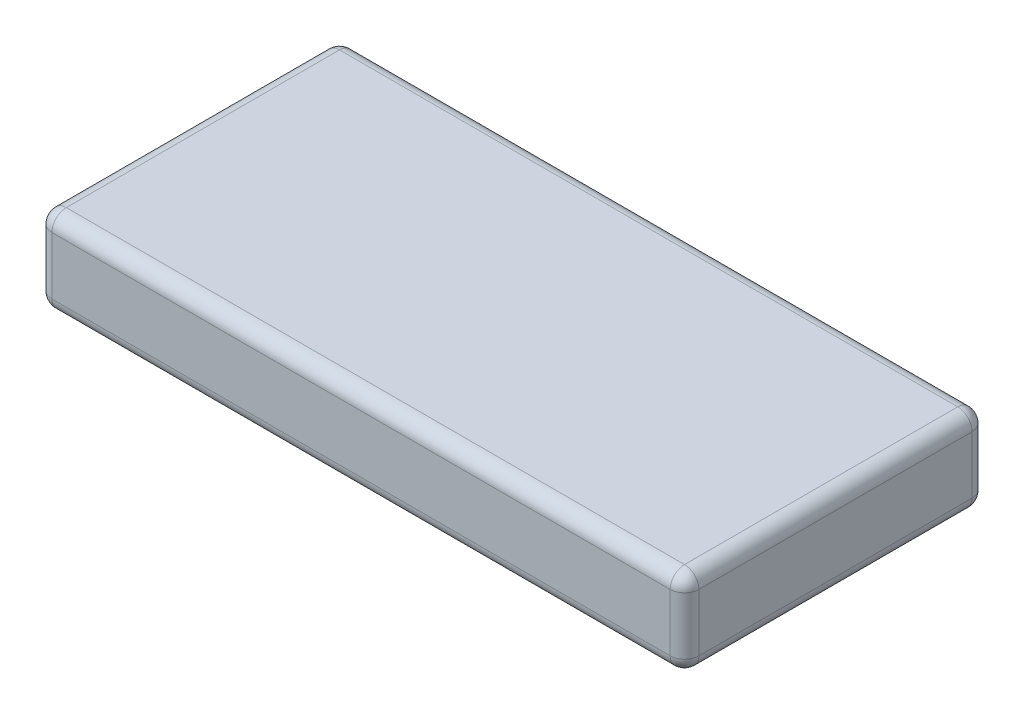
ISO-10303-21;
HEADER;
FILE_DESCRIPTION(('STEP AP214'),'2;1');
FILE_NAME('part.step','',(''),(''),'','','');
FILE_SCHEMA(('AUTOMOTIVE_DESIGN { 1 0 10303 214 1 1 1 1 }'));
ENDSEC;
DATA;
#1=APPLICATION_CONTEXT('core data for automotive mechanical design processes');
#2=APPLICATION_PROTOCOL_DEFINITION('international standard','automotive_design',2000,#1);
#3=PRODUCT_CONTEXT('',#1,'mechanical');
#4=PRODUCT('Part','Part','',(#3));
#5=PRODUCT_RELATED_PRODUCT_CATEGORY('part','',(#4));
#6=PRODUCT_DEFINITION_FORMATION('','',#4);
#7=PRODUCT_DEFINITION_CONTEXT('part definition',#1,'design');
#8=PRODUCT_DEFINITION('design','',#6,#7);
#9=PRODUCT_DEFINITION_SHAPE('','',#8);
#10=(LENGTH_UNIT() NAMED_UNIT(*) SI_UNIT(.MILLI.,.METRE.));
#11=(NAMED_UNIT(*) PLANE_ANGLE_UNIT() SI_UNIT($,.RADIAN.));
#12=(NAMED_UNIT(*) SI_UNIT($,.STERADIAN.) SOLID_ANGLE_UNIT());
#13=UNCERTAINTY_MEASURE_WITH_UNIT(LENGTH_MEASURE(1.E-05),#10,'distance_accuracy_value','');
#14=(GEOMETRIC_REPRESENTATION_CONTEXT(3) GLOBAL_UNCERTAINTY_ASSIGNED_CONTEXT((#13)) GLOBAL_UNIT_ASSIGNED_CONTEXT((#10,
#11,#12)) REPRESENTATION_CONTEXT('',''));
#15=CARTESIAN_POINT('',(0.,0.,0.));
#16=DIRECTION('',(0.,0.,1.));
#17=DIRECTION('',(1.,0.,0.));
#18=AXIS2_PLACEMENT_3D('',#15,#16,#17);
#19=CARTESIAN_POINT('',(0.,22.86,0.));
#20=DIRECTION('',(1.,0.,0.));
#21=DIRECTION('',(0.,0.,-1.));
#22=AXIS2_PLACEMENT_3D('',#19,#20,#21);
#23=PLANE('',#22);
#24=DIRECTION('',(0.,0.,1.));
#25=VECTOR('',#24,1.);
#26=CARTESIAN_POINT('',(0.,19.05,0.));
#27=LINE('',#26,#25);
#28=CARTESIAN_POINT('',(0.,19.05,-3.81));
#29=VERTEX_POINT('',#28);
#30=CARTESIAN_POINT('',(0.,19.05,-76.2));
#31=VERTEX_POINT('',#30);
#32=EDGE_CURVE('E186',#29,#31,#27,.F.);
#33=ORIENTED_EDGE('',*,*,#32,.T.);
#34=DIRECTION('',(0.,-1.,0.));
#35=VECTOR('',#34,1.);
#36=CARTESIAN_POINT('',(0.,22.86,-76.2));
#37=LINE('',#36,#35);
#38=CARTESIAN_POINT('',(0.,3.81,-76.2));
#39=VERTEX_POINT('',#38);
#40=EDGE_CURVE('E140',#31,#39,#37,.T.);
#41=ORIENTED_EDGE('',*,*,#40,.T.);
#42=DIRECTION('',(0.,0.,1.));
#43=VECTOR('',#42,1.);
#44=CARTESIAN_POINT('',(0.,3.81,0.));
#45=LINE('',#44,#43);
#46=CARTESIAN_POINT('',(0.,3.81,-3.81));
#47=VERTEX_POINT('',#46);
#48=EDGE_CURVE('E188',#39,#47,#45,.T.);
#49=ORIENTED_EDGE('',*,*,#48,.T.);
#50=DIRECTION('',(0.,-1.,0.));
#51=VECTOR('',#50,1.);
#52=CARTESIAN_POINT('',(0.,22.86,-3.81));
#53=LINE('',#52,#51);
#54=EDGE_CURVE('E184',#47,#29,#53,.F.);
#55=ORIENTED_EDGE('',*,*,#54,.T.);
#56=EDGE_LOOP('',(#33,#41,#49,#55));
#57=FACE_BOUND('',#56,.T.);
#58=ADVANCED_FACE('F34',(#57),#23,.F.);
#59=CARTESIAN_POINT('',(0.,22.86,0.));
#60=DIRECTION('',(0.,0.,-1.));
#61=DIRECTION('',(-1.,0.,0.));
#62=AXIS2_PLACEMENT_3D('',#59,#60,#61);
#63=PLANE('',#62);
#64=DIRECTION('',(1.,0.,0.));
#65=VECTOR('',#64,1.);
#66=CARTESIAN_POINT('',(0.,19.05,0.));
#67=LINE('',#66,#65);
#68=CARTESIAN_POINT('',(167.64,19.05,0.));
#69=VERTEX_POINT('',#68);
#70=CARTESIAN_POINT('',(3.81,19.05,0.));
#71=VERTEX_POINT('',#70);
#72=EDGE_CURVE('E43',#69,#71,#67,.F.);
#73=ORIENTED_EDGE('',*,*,#72,.T.);
#74=DIRECTION('',(0.,-1.,0.));
#75=VECTOR('',#74,1.);
#76=CARTESIAN_POINT('',(3.81,22.86,0.));
#77=LINE('',#76,#75);
#78=CARTESIAN_POINT('',(3.81,3.81,0.));
#79=VERTEX_POINT('',#78);
#80=EDGE_CURVE('E11',#71,#79,#77,.T.);
#81=ORIENTED_EDGE('',*,*,#80,.T.);
#82=DIRECTION('',(1.,0.,0.));
#83=VECTOR('',#82,1.);
#84=CARTESIAN_POINT('',(171.45,3.81,0.));
#85=LINE('',#84,#83);
#86=CARTESIAN_POINT('',(167.64,3.81,0.));
#87=VERTEX_POINT('',#86);
#88=EDGE_CURVE('E200',#79,#87,#85,.T.);
#89=ORIENTED_EDGE('',*,*,#88,.T.);
#90=DIRECTION('',(0.,-1.,0.));
#91=VECTOR('',#90,1.);
#92=CARTESIAN_POINT('',(167.64,22.86,0.));
#93=LINE('',#92,#91);
#94=EDGE_CURVE('E54',#87,#69,#93,.F.);
#95=ORIENTED_EDGE('',*,*,#94,.T.);
#96=EDGE_LOOP('',(#73,#81,#89,#95));
#97=FACE_BOUND('',#96,.T.);
#98=ADVANCED_FACE('F273',(#97),#63,.F.);
#99=CARTESIAN_POINT('',(171.45,22.86,0.));
#100=DIRECTION('',(-1.,0.,0.));
#101=DIRECTION('',(0.,0.,1.));
#102=AXIS2_PLACEMENT_3D('',#99,#100,#101);
#103=PLANE('',#102);
#104=DIRECTION('',(0.,0.,-1.));
#105=VECTOR('',#104,1.);
#106=CARTESIAN_POINT('',(171.45,3.81,-80.01));
#107=LINE('',#106,#105);
#108=CARTESIAN_POINT('',(171.45,3.81,-3.81));
#109=VERTEX_POINT('',#108);
#110=CARTESIAN_POINT('',(171.45,3.81,-76.2));
#111=VERTEX_POINT('',#110);
#112=EDGE_CURVE('E170',#109,#111,#107,.T.);
#113=ORIENTED_EDGE('',*,*,#112,.T.);
#114=DIRECTION('',(0.,-1.,0.));
#115=VECTOR('',#114,1.);
#116=CARTESIAN_POINT('',(171.45,22.86,-76.2));
#117=LINE('',#116,#115);
#118=CARTESIAN_POINT('',(171.45,19.05,-76.2));
#119=VERTEX_POINT('',#118);
#120=EDGE_CURVE('E172',#111,#119,#117,.F.);
#121=ORIENTED_EDGE('',*,*,#120,.T.);
#122=DIRECTION('',(0.,0.,-1.));
#123=VECTOR('',#122,1.);
#124=CARTESIAN_POINT('',(171.45,19.05,0.));
#125=LINE('',#124,#123);
#126=CARTESIAN_POINT('',(171.45,19.05,-3.81));
#127=VERTEX_POINT('',#126);
#128=EDGE_CURVE('E168',#119,#127,#125,.F.);
#129=ORIENTED_EDGE('',*,*,#128,.T.);
#130=DIRECTION('',(0.,-1.,0.));
#131=VECTOR('',#130,1.);
#132=CARTESIAN_POINT('',(171.45,22.86,-3.81));
#133=LINE('',#132,#131);
#134=EDGE_CURVE('E166',#127,#109,#133,.T.);
#135=ORIENTED_EDGE('',*,*,#134,.T.);
#136=EDGE_LOOP('',(#113,#121,#129,#135));
#137=FACE_BOUND('',#136,.T.);
#138=ADVANCED_FACE('F333',(#137),#103,.F.);
#139=CARTESIAN_POINT('',(0.,22.86,-80.01));
#140=DIRECTION('',(0.,0.,1.));
#141=DIRECTION('',(1.,0.,0.));
#142=AXIS2_PLACEMENT_3D('',#139,#140,#141);
#143=PLANE('',#142);
#144=DIRECTION('',(-1.,0.,0.));
#145=VECTOR('',#144,1.);
#146=CARTESIAN_POINT('',(0.,19.05,-80.01));
#147=LINE('',#146,#145);
#148=CARTESIAN_POINT('',(3.81,19.05,-80.01));
#149=VERTEX_POINT('',#148);
#150=CARTESIAN_POINT('',(167.64,19.05,-80.01));
#151=VERTEX_POINT('',#150);
#152=EDGE_CURVE('E126',#149,#151,#147,.F.);
#153=ORIENTED_EDGE('',*,*,#152,.T.);
#154=DIRECTION('',(0.,-1.,0.));
#155=VECTOR('',#154,1.);
#156=CARTESIAN_POINT('',(167.64,22.86,-80.01));
#157=LINE('',#156,#155);
#158=CARTESIAN_POINT('',(167.64,3.81,-80.01));
#159=VERTEX_POINT('',#158);
#160=EDGE_CURVE('E164',#151,#159,#157,.T.);
#161=ORIENTED_EDGE('',*,*,#160,.T.);
#162=DIRECTION('',(-1.,0.,0.));
#163=VECTOR('',#162,1.);
#164=CARTESIAN_POINT('',(0.,3.81,-80.01));
#165=LINE('',#164,#163);
#166=CARTESIAN_POINT('',(3.81,3.81,-80.01));
#167=VERTEX_POINT('',#166);
#168=EDGE_CURVE('E129',#159,#167,#165,.T.);
#169=ORIENTED_EDGE('',*,*,#168,.T.);
#170=DIRECTION('',(0.,-1.,0.));
#171=VECTOR('',#170,1.);
#172=CARTESIAN_POINT('',(3.81,22.86,-80.01));
#173=LINE('',#172,#171);
#174=EDGE_CURVE('E121',#167,#149,#173,.F.);
#175=ORIENTED_EDGE('',*,*,#174,.T.);
#176=EDGE_LOOP('',(#153,#161,#169,#175));
#177=FACE_BOUND('',#176,.T.);
#178=ADVANCED_FACE('F123',(#177),#143,.F.);
#179=CARTESIAN_POINT('',(0.,22.86,0.));
#180=DIRECTION('',(0.,-1.,0.));
#181=DIRECTION('',(0.,0.,-1.));
#182=AXIS2_PLACEMENT_3D('',#179,#180,#181);
#183=PLANE('',#182);
#184=DIRECTION('',(0.,0.,-1.));
#185=VECTOR('',#184,1.);
#186=CARTESIAN_POINT('',(167.64,22.86,0.));
#187=LINE('',#186,#185);
#188=CARTESIAN_POINT('',(167.64,22.86,-3.81));
#189=VERTEX_POINT('',#188);
#190=CARTESIAN_POINT('',(167.64,22.86,-76.2));
#191=VERTEX_POINT('',#190);
#192=EDGE_CURVE('E195',#189,#191,#187,.T.);
#193=ORIENTED_EDGE('',*,*,#192,.T.);
#194=DIRECTION('',(-1.,0.,0.));
#195=VECTOR('',#194,1.);
#196=CARTESIAN_POINT('',(0.,22.86,-76.2));
#197=LINE('',#196,#195);
#198=CARTESIAN_POINT('',(3.81,22.86,-76.2));
#199=VERTEX_POINT('',#198);
#200=EDGE_CURVE('E197',#191,#199,#197,.T.);
#201=ORIENTED_EDGE('',*,*,#200,.T.);
#202=DIRECTION('',(0.,0.,1.));
#203=VECTOR('',#202,1.);
#204=CARTESIAN_POINT('',(3.81,22.86,0.));
#205=LINE('',#204,#203);
#206=CARTESIAN_POINT('',(3.81,22.86,-3.81));
#207=VERTEX_POINT('',#206);
#208=EDGE_CURVE('E193',#199,#207,#205,.T.);
#209=ORIENTED_EDGE('',*,*,#208,.T.);
#210=DIRECTION('',(1.,0.,0.));
#211=VECTOR('',#210,1.);
#212=CARTESIAN_POINT('',(0.,22.86,-3.81));
#213=LINE('',#212,#211);
#214=EDGE_CURVE('E191',#207,#189,#213,.T.);
#215=ORIENTED_EDGE('',*,*,#214,.T.);
#216=EDGE_LOOP('',(#193,#201,#209,#215));
#217=FACE_BOUND('',#216,.T.);
#218=ADVANCED_FACE('F298',(#217),#183,.F.);
#219=CARTESIAN_POINT('',(0.,0.,0.));
#220=DIRECTION('',(0.,-1.,0.));
#221=DIRECTION('',(0.,0.,-1.));
#222=AXIS2_PLACEMENT_3D('',#219,#220,#221);
#223=PLANE('',#222);
#224=DIRECTION('',(-1.,0.,0.));
#225=VECTOR('',#224,1.);
#226=CARTESIAN_POINT('',(171.45,0.,-76.2));
#227=LINE('',#226,#225);
#228=CARTESIAN_POINT('',(3.81,0.,-76.2));
#229=VERTEX_POINT('',#228);
#230=CARTESIAN_POINT('',(167.64,0.,-76.2));
#231=VERTEX_POINT('',#230);
#232=EDGE_CURVE('E179',#229,#231,#227,.F.);
#233=ORIENTED_EDGE('',*,*,#232,.T.);
#234=DIRECTION('',(0.,0.,-1.));
#235=VECTOR('',#234,1.);
#236=CARTESIAN_POINT('',(167.64,0.,0.));
#237=LINE('',#236,#235);
#238=CARTESIAN_POINT('',(167.64,0.,-3.81));
#239=VERTEX_POINT('',#238);
#240=EDGE_CURVE('E181',#231,#239,#237,.F.);
#241=ORIENTED_EDGE('',*,*,#240,.T.);
#242=DIRECTION('',(1.,0.,0.));
#243=VECTOR('',#242,1.);
#244=CARTESIAN_POINT('',(0.,0.,-3.81));
#245=LINE('',#244,#243);
#246=CARTESIAN_POINT('',(3.81,0.,-3.81));
#247=VERTEX_POINT('',#246);
#248=EDGE_CURVE('E175',#239,#247,#245,.F.);
#249=ORIENTED_EDGE('',*,*,#248,.T.);
#250=DIRECTION('',(0.,0.,1.));
#251=VECTOR('',#250,1.);
#252=CARTESIAN_POINT('',(3.81,0.,-80.01));
#253=LINE('',#252,#251);
#254=EDGE_CURVE('E177',#247,#229,#253,.F.);
#255=ORIENTED_EDGE('',*,*,#254,.T.);
#256=EDGE_LOOP('',(#233,#241,#249,#255));
#257=FACE_BOUND('',#256,.T.);
#258=ADVANCED_FACE('F266',(#257),#223,.T.);
#259=CARTESIAN_POINT('',(3.81,22.86,-3.81));
#260=DIRECTION('',(0.,-1.,0.));
#261=DIRECTION('',(0.,0.,-1.));
#262=AXIS2_PLACEMENT_3D('',#259,#260,#261);
#263=CYLINDRICAL_SURFACE('',#262,3.81);
#264=CARTESIAN_POINT('',(3.81,19.05,-3.81));
#265=DIRECTION('',(0.,1.,0.));
#266=DIRECTION('',(0.,0.,1.));
#267=AXIS2_PLACEMENT_3D('',#264,#265,#266);
#268=CIRCLE('',#267,3.81);
#269=EDGE_CURVE('E38',#29,#71,#268,.T.);
#270=ORIENTED_EDGE('',*,*,#269,.F.);
#271=ORIENTED_EDGE('',*,*,#54,.F.);
#272=CARTESIAN_POINT('',(3.81,3.81,-3.81));
#273=DIRECTION('',(0.,-1.,0.));
#274=DIRECTION('',(0.,0.,-1.));
#275=AXIS2_PLACEMENT_3D('',#272,#273,#274);
#276=CIRCLE('',#275,3.81);
#277=EDGE_CURVE('E161',#79,#47,#276,.T.);
#278=ORIENTED_EDGE('',*,*,#277,.F.);
#279=ORIENTED_EDGE('',*,*,#80,.F.);
#280=EDGE_LOOP('',(#270,#271,#278,#279));
#281=FACE_BOUND('',#280,.T.);
#282=ADVANCED_FACE('F36',(#281),#263,.T.);
#283=CARTESIAN_POINT('',(3.81,19.05,-3.81));
#284=DIRECTION('',(0.,0.,1.));
#285=DIRECTION('',(1.,0.,0.));
#286=AXIS2_PLACEMENT_3D('',#283,#284,#285);
#287=SPHERICAL_SURFACE('',#286,3.81);
#288=CARTESIAN_POINT('',(3.81,19.05,-3.81));
#289=DIRECTION('',(0.,0.,1.));
#290=DIRECTION('',(1.,0.,0.));
#291=AXIS2_PLACEMENT_3D('',#288,#289,#290);
#292=CIRCLE('',#291,3.81);
#293=EDGE_CURVE('E246',#29,#207,#292,.F.);
#294=ORIENTED_EDGE('',*,*,#293,.F.);
#295=ORIENTED_EDGE('',*,*,#269,.T.);
#296=CARTESIAN_POINT('',(3.81,19.05,-3.81));
#297=DIRECTION('',(-1.,0.,0.));
#298=DIRECTION('',(0.,0.,1.));
#299=AXIS2_PLACEMENT_3D('',#296,#297,#298);
#300=CIRCLE('',#299,3.81);
#301=EDGE_CURVE('E249',#207,#71,#300,.F.);
#302=ORIENTED_EDGE('',*,*,#301,.F.);
#303=EDGE_LOOP('',(#294,#295,#302));
#304=FACE_BOUND('',#303,.T.);
#305=ADVANCED_FACE('F291',(#304),#287,.T.);
#306=CARTESIAN_POINT('',(3.81,3.81,-3.81));
#307=DIRECTION('',(0.,0.,1.));
#308=DIRECTION('',(1.,0.,0.));
#309=AXIS2_PLACEMENT_3D('',#306,#307,#308);
#310=SPHERICAL_SURFACE('',#309,3.81);
#311=CARTESIAN_POINT('',(3.81,3.81,-3.81));
#312=DIRECTION('',(-1.,0.,0.));
#313=DIRECTION('',(0.,0.,1.));
#314=AXIS2_PLACEMENT_3D('',#311,#312,#313);
#315=CIRCLE('',#314,3.81);
#316=EDGE_CURVE('E240',#79,#247,#315,.F.);
#317=ORIENTED_EDGE('',*,*,#316,.F.);
#318=ORIENTED_EDGE('',*,*,#277,.T.);
#319=CARTESIAN_POINT('',(3.81,3.81,-3.81));
#320=DIRECTION('',(0.,0.,1.));
#321=DIRECTION('',(1.,0.,0.));
#322=AXIS2_PLACEMENT_3D('',#319,#320,#321);
#323=CIRCLE('',#322,3.81);
#324=EDGE_CURVE('E243',#247,#47,#323,.F.);
#325=ORIENTED_EDGE('',*,*,#324,.F.);
#326=EDGE_LOOP('',(#317,#318,#325));
#327=FACE_BOUND('',#326,.T.);
#328=ADVANCED_FACE('F256',(#327),#310,.T.);
#329=CARTESIAN_POINT('',(0.,19.05,-3.81));
#330=DIRECTION('',(1.,0.,0.));
#331=DIRECTION('',(0.,0.,-1.));
#332=AXIS2_PLACEMENT_3D('',#329,#330,#331);
#333=CYLINDRICAL_SURFACE('',#332,3.81);
#334=ORIENTED_EDGE('',*,*,#301,.T.);
#335=ORIENTED_EDGE('',*,*,#72,.F.);
#336=CARTESIAN_POINT('',(167.64,19.05,-3.81));
#337=DIRECTION('',(1.,0.,0.));
#338=DIRECTION('',(0.,0.,-1.));
#339=AXIS2_PLACEMENT_3D('',#336,#337,#338);
#340=CIRCLE('',#339,3.81);
#341=EDGE_CURVE('E234',#189,#69,#340,.T.);
#342=ORIENTED_EDGE('',*,*,#341,.F.);
#343=ORIENTED_EDGE('',*,*,#214,.F.);
#344=EDGE_LOOP('',(#334,#335,#342,#343));
#345=FACE_BOUND('',#344,.T.);
#346=ADVANCED_FACE('F287',(#345),#333,.T.);
#347=CARTESIAN_POINT('',(3.81,19.05,0.));
#348=DIRECTION('',(0.,0.,1.));
#349=DIRECTION('',(1.,0.,0.));
#350=AXIS2_PLACEMENT_3D('',#347,#348,#349);
#351=CYLINDRICAL_SURFACE('',#350,3.81);
#352=ORIENTED_EDGE('',*,*,#293,.T.);
#353=ORIENTED_EDGE('',*,*,#208,.F.);
#354=CARTESIAN_POINT('',(3.81,19.05,-76.2));
#355=DIRECTION('',(0.,0.,-1.));
#356=DIRECTION('',(-1.,0.,0.));
#357=AXIS2_PLACEMENT_3D('',#354,#355,#356);
#358=CIRCLE('',#357,3.81);
#359=EDGE_CURVE('E144',#31,#199,#358,.T.);
#360=ORIENTED_EDGE('',*,*,#359,.F.);
#361=ORIENTED_EDGE('',*,*,#32,.F.);
#362=EDGE_LOOP('',(#352,#353,#360,#361));
#363=FACE_BOUND('',#362,.T.);
#364=ADVANCED_FACE('F296',(#363),#351,.T.);
#365=CARTESIAN_POINT('',(3.81,22.86,-76.2));
#366=DIRECTION('',(0.,-1.,0.));
#367=DIRECTION('',(0.,0.,-1.));
#368=AXIS2_PLACEMENT_3D('',#365,#366,#367);
#369=CYLINDRICAL_SURFACE('',#368,3.81);
#370=CARTESIAN_POINT('',(3.81,3.81,-76.2));
#371=DIRECTION('',(0.,-1.,0.));
#372=DIRECTION('',(0.,0.,-1.));
#373=AXIS2_PLACEMENT_3D('',#370,#371,#372);
#374=CIRCLE('',#373,3.81);
#375=EDGE_CURVE('E145',#39,#167,#374,.T.);
#376=ORIENTED_EDGE('',*,*,#375,.F.);
#377=ORIENTED_EDGE('',*,*,#40,.F.);
#378=CARTESIAN_POINT('',(3.81,19.05,-76.2));
#379=DIRECTION('',(0.,1.,0.));
#380=DIRECTION('',(0.,0.,1.));
#381=AXIS2_PLACEMENT_3D('',#378,#379,#380);
#382=CIRCLE('',#381,3.81);
#383=EDGE_CURVE('E136',#149,#31,#382,.T.);
#384=ORIENTED_EDGE('',*,*,#383,.F.);
#385=ORIENTED_EDGE('',*,*,#174,.F.);
#386=EDGE_LOOP('',(#376,#377,#384,#385));
#387=FACE_BOUND('',#386,.T.);
#388=ADVANCED_FACE('F138',(#387),#369,.T.);
#389=CARTESIAN_POINT('',(3.81,3.81,0.));
#390=DIRECTION('',(0.,0.,-1.));
#391=DIRECTION('',(-1.,0.,0.));
#392=AXIS2_PLACEMENT_3D('',#389,#390,#391);
#393=CYLINDRICAL_SURFACE('',#392,3.81);
#394=ORIENTED_EDGE('',*,*,#324,.T.);
#395=ORIENTED_EDGE('',*,*,#48,.F.);
#396=CARTESIAN_POINT('',(3.81,3.81,-76.2));
#397=DIRECTION('',(0.,0.,-1.));
#398=DIRECTION('',(-1.,0.,0.));
#399=AXIS2_PLACEMENT_3D('',#396,#397,#398);
#400=CIRCLE('',#399,3.81);
#401=EDGE_CURVE('E230',#229,#39,#400,.T.);
#402=ORIENTED_EDGE('',*,*,#401,.F.);
#403=ORIENTED_EDGE('',*,*,#254,.F.);
#404=EDGE_LOOP('',(#394,#395,#402,#403));
#405=FACE_BOUND('',#404,.T.);
#406=ADVANCED_FACE('F262',(#405),#393,.T.);
#407=CARTESIAN_POINT('',(0.,3.81,-3.81));
#408=DIRECTION('',(-1.,0.,0.));
#409=DIRECTION('',(0.,0.,1.));
#410=AXIS2_PLACEMENT_3D('',#407,#408,#409);
#411=CYLINDRICAL_SURFACE('',#410,3.81);
#412=ORIENTED_EDGE('',*,*,#316,.T.);
#413=ORIENTED_EDGE('',*,*,#248,.F.);
#414=CARTESIAN_POINT('',(167.64,3.81,-3.81));
#415=DIRECTION('',(1.,0.,0.));
#416=DIRECTION('',(0.,0.,-1.));
#417=AXIS2_PLACEMENT_3D('',#414,#415,#416);
#418=CIRCLE('',#417,3.81);
#419=EDGE_CURVE('E227',#87,#239,#418,.T.);
#420=ORIENTED_EDGE('',*,*,#419,.F.);
#421=ORIENTED_EDGE('',*,*,#88,.F.);
#422=EDGE_LOOP('',(#412,#413,#420,#421));
#423=FACE_BOUND('',#422,.T.);
#424=ADVANCED_FACE('F272',(#423),#411,.T.);
#425=CARTESIAN_POINT('',(167.64,22.86,-3.81));
#426=DIRECTION('',(0.,-1.,0.));
#427=DIRECTION('',(0.,0.,-1.));
#428=AXIS2_PLACEMENT_3D('',#425,#426,#427);
#429=CYLINDRICAL_SURFACE('',#428,3.81);
#430=CARTESIAN_POINT('',(167.64,19.05,-3.81));
#431=DIRECTION('',(0.,1.,0.));
#432=DIRECTION('',(0.,0.,1.));
#433=AXIS2_PLACEMENT_3D('',#430,#431,#432);
#434=CIRCLE('',#433,3.81);
#435=EDGE_CURVE('E237',#69,#127,#434,.T.);
#436=ORIENTED_EDGE('',*,*,#435,.F.);
#437=ORIENTED_EDGE('',*,*,#94,.F.);
#438=CARTESIAN_POINT('',(167.64,3.81,-3.81));
#439=DIRECTION('',(0.,-1.,0.));
#440=DIRECTION('',(0.,0.,-1.));
#441=AXIS2_PLACEMENT_3D('',#438,#439,#440);
#442=CIRCLE('',#441,3.81);
#443=EDGE_CURVE('E224',#109,#87,#442,.T.);
#444=ORIENTED_EDGE('',*,*,#443,.F.);
#445=ORIENTED_EDGE('',*,*,#134,.F.);
#446=EDGE_LOOP('',(#436,#437,#444,#445));
#447=FACE_BOUND('',#446,.T.);
#448=ADVANCED_FACE('F277',(#447),#429,.T.);
#449=CARTESIAN_POINT('',(167.64,19.05,-3.81));
#450=DIRECTION('',(0.,0.,1.));
#451=DIRECTION('',(1.,0.,0.));
#452=AXIS2_PLACEMENT_3D('',#449,#450,#451);
#453=SPHERICAL_SURFACE('',#452,3.81);
#454=ORIENTED_EDGE('',*,*,#341,.T.);
#455=ORIENTED_EDGE('',*,*,#435,.T.);
#456=CARTESIAN_POINT('',(167.64,19.05,-3.81));
#457=DIRECTION('',(0.,0.,1.));
#458=DIRECTION('',(1.,0.,0.));
#459=AXIS2_PLACEMENT_3D('',#456,#457,#458);
#460=CIRCLE('',#459,3.81);
#461=EDGE_CURVE('E152',#189,#127,#460,.F.);
#462=ORIENTED_EDGE('',*,*,#461,.F.);
#463=EDGE_LOOP('',(#454,#455,#462));
#464=FACE_BOUND('',#463,.T.);
#465=ADVANCED_FACE('F283',(#464),#453,.T.);
#466=CARTESIAN_POINT('',(3.81,19.05,-76.2));
#467=DIRECTION('',(0.,0.,1.));
#468=DIRECTION('',(1.,0.,0.));
#469=AXIS2_PLACEMENT_3D('',#466,#467,#468);
#470=SPHERICAL_SURFACE('',#469,3.81);
#471=ORIENTED_EDGE('',*,*,#383,.T.);
#472=ORIENTED_EDGE('',*,*,#359,.T.);
#473=CARTESIAN_POINT('',(3.81,19.05,-76.2));
#474=DIRECTION('',(-1.,0.,0.));
#475=DIRECTION('',(0.,0.,1.));
#476=AXIS2_PLACEMENT_3D('',#473,#474,#475);
#477=CIRCLE('',#476,3.81);
#478=EDGE_CURVE('E147',#149,#199,#477,.F.);
#479=ORIENTED_EDGE('',*,*,#478,.F.);
#480=EDGE_LOOP('',(#471,#472,#479));
#481=FACE_BOUND('',#480,.T.);
#482=ADVANCED_FACE('F148',(#481),#470,.T.);
#483=CARTESIAN_POINT('',(3.81,3.81,-76.2));
#484=DIRECTION('',(0.,0.,1.));
#485=DIRECTION('',(1.,0.,0.));
#486=AXIS2_PLACEMENT_3D('',#483,#484,#485);
#487=SPHERICAL_SURFACE('',#486,3.81);
#488=ORIENTED_EDGE('',*,*,#401,.T.);
#489=ORIENTED_EDGE('',*,*,#375,.T.);
#490=CARTESIAN_POINT('',(3.81,3.81,-76.2));
#491=DIRECTION('',(-1.,0.,0.));
#492=DIRECTION('',(0.,0.,1.));
#493=AXIS2_PLACEMENT_3D('',#490,#491,#492);
#494=CIRCLE('',#493,3.81);
#495=EDGE_CURVE('E153',#229,#167,#494,.F.);
#496=ORIENTED_EDGE('',*,*,#495,.F.);
#497=EDGE_LOOP('',(#488,#489,#496));
#498=FACE_BOUND('',#497,.T.);
#499=ADVANCED_FACE('F317',(#498),#487,.T.);
#500=CARTESIAN_POINT('',(167.64,3.81,-3.81));
#501=DIRECTION('',(0.,0.,1.));
#502=DIRECTION('',(1.,0.,0.));
#503=AXIS2_PLACEMENT_3D('',#500,#501,#502);
#504=SPHERICAL_SURFACE('',#503,3.81);
#505=ORIENTED_EDGE('',*,*,#443,.T.);
#506=ORIENTED_EDGE('',*,*,#419,.T.);
#507=CARTESIAN_POINT('',(167.64,3.81,-3.81));
#508=DIRECTION('',(0.,0.,1.));
#509=DIRECTION('',(1.,0.,0.));
#510=AXIS2_PLACEMENT_3D('',#507,#508,#509);
#511=CIRCLE('',#510,3.81);
#512=EDGE_CURVE('E218',#109,#239,#511,.F.);
#513=ORIENTED_EDGE('',*,*,#512,.F.);
#514=EDGE_LOOP('',(#505,#506,#513));
#515=FACE_BOUND('',#514,.T.);
#516=ADVANCED_FACE('F319',(#515),#504,.T.);
#517=CARTESIAN_POINT('',(167.64,19.05,0.));
#518=DIRECTION('',(0.,0.,-1.));
#519=DIRECTION('',(-1.,0.,0.));
#520=AXIS2_PLACEMENT_3D('',#517,#518,#519);
#521=CYLINDRICAL_SURFACE('',#520,3.81);
#522=ORIENTED_EDGE('',*,*,#461,.T.);
#523=ORIENTED_EDGE('',*,*,#128,.F.);
#524=CARTESIAN_POINT('',(167.64,19.05,-76.2));
#525=DIRECTION('',(0.,0.,-1.));
#526=DIRECTION('',(-1.,0.,0.));
#527=AXIS2_PLACEMENT_3D('',#524,#525,#526);
#528=CIRCLE('',#527,3.81);
#529=EDGE_CURVE('E215',#191,#119,#528,.T.);
#530=ORIENTED_EDGE('',*,*,#529,.F.);
#531=ORIENTED_EDGE('',*,*,#192,.F.);
#532=EDGE_LOOP('',(#522,#523,#530,#531));
#533=FACE_BOUND('',#532,.T.);
#534=ADVANCED_FACE('F302',(#533),#521,.T.);
#535=CARTESIAN_POINT('',(0.,19.05,-76.2));
#536=DIRECTION('',(-1.,0.,0.));
#537=DIRECTION('',(0.,0.,1.));
#538=AXIS2_PLACEMENT_3D('',#535,#536,#537);
#539=CYLINDRICAL_SURFACE('',#538,3.81);
#540=ORIENTED_EDGE('',*,*,#478,.T.);
#541=ORIENTED_EDGE('',*,*,#200,.F.);
#542=CARTESIAN_POINT('',(167.64,19.05,-76.2));
#543=DIRECTION('',(1.,0.,0.));
#544=DIRECTION('',(0.,0.,-1.));
#545=AXIS2_PLACEMENT_3D('',#542,#543,#544);
#546=CIRCLE('',#545,3.81);
#547=EDGE_CURVE('E157',#151,#191,#546,.T.);
#548=ORIENTED_EDGE('',*,*,#547,.F.);
#549=ORIENTED_EDGE('',*,*,#152,.F.);
#550=EDGE_LOOP('',(#540,#541,#548,#549));
#551=FACE_BOUND('',#550,.T.);
#552=ADVANCED_FACE('F155',(#551),#539,.T.);
#553=CARTESIAN_POINT('',(0.,3.81,-76.2));
#554=DIRECTION('',(1.,0.,0.));
#555=DIRECTION('',(0.,0.,-1.));
#556=AXIS2_PLACEMENT_3D('',#553,#554,#555);
#557=CYLINDRICAL_SURFACE('',#556,3.81);
#558=ORIENTED_EDGE('',*,*,#495,.T.);
#559=ORIENTED_EDGE('',*,*,#168,.F.);
#560=CARTESIAN_POINT('',(167.64,3.81,-76.2));
#561=DIRECTION('',(1.,0.,0.));
#562=DIRECTION('',(0.,0.,-1.));
#563=AXIS2_PLACEMENT_3D('',#560,#561,#562);
#564=CIRCLE('',#563,3.81);
#565=EDGE_CURVE('E211',#231,#159,#564,.T.);
#566=ORIENTED_EDGE('',*,*,#565,.F.);
#567=ORIENTED_EDGE('',*,*,#232,.F.);
#568=EDGE_LOOP('',(#558,#559,#566,#567));
#569=FACE_BOUND('',#568,.T.);
#570=ADVANCED_FACE('F315',(#569),#557,.T.);
#571=CARTESIAN_POINT('',(167.64,3.81,0.));
#572=DIRECTION('',(0.,0.,1.));
#573=DIRECTION('',(1.,0.,0.));
#574=AXIS2_PLACEMENT_3D('',#571,#572,#573);
#575=CYLINDRICAL_SURFACE('',#574,3.81);
#576=ORIENTED_EDGE('',*,*,#512,.T.);
#577=ORIENTED_EDGE('',*,*,#240,.F.);
#578=CARTESIAN_POINT('',(167.64,3.81,-76.2));
#579=DIRECTION('',(0.,0.,-1.));
#580=DIRECTION('',(-1.,0.,0.));
#581=AXIS2_PLACEMENT_3D('',#578,#579,#580);
#582=CIRCLE('',#581,3.81);
#583=EDGE_CURVE('E208',#111,#231,#582,.T.);
#584=ORIENTED_EDGE('',*,*,#583,.F.);
#585=ORIENTED_EDGE('',*,*,#112,.F.);
#586=EDGE_LOOP('',(#576,#577,#584,#585));
#587=FACE_BOUND('',#586,.T.);
#588=ADVANCED_FACE('F343',(#587),#575,.T.);
#589=CARTESIAN_POINT('',(167.64,19.05,-76.2));
#590=DIRECTION('',(0.,0.,1.));
#591=DIRECTION('',(1.,0.,0.));
#592=AXIS2_PLACEMENT_3D('',#589,#590,#591);
#593=SPHERICAL_SURFACE('',#592,3.81);
#594=ORIENTED_EDGE('',*,*,#547,.T.);
#595=ORIENTED_EDGE('',*,*,#529,.T.);
#596=CARTESIAN_POINT('',(167.64,19.05,-76.2));
#597=DIRECTION('',(0.,1.,0.));
#598=DIRECTION('',(0.,0.,1.));
#599=AXIS2_PLACEMENT_3D('',#596,#597,#598);
#600=CIRCLE('',#599,3.81);
#601=EDGE_CURVE('E206',#151,#119,#600,.F.);
#602=ORIENTED_EDGE('',*,*,#601,.F.);
#603=EDGE_LOOP('',(#594,#595,#602));
#604=FACE_BOUND('',#603,.T.);
#605=ADVANCED_FACE('F304',(#604),#593,.T.);
#606=CARTESIAN_POINT('',(167.64,3.81,-76.2));
#607=DIRECTION('',(0.,0.,1.));
#608=DIRECTION('',(1.,0.,0.));
#609=AXIS2_PLACEMENT_3D('',#606,#607,#608);
#610=SPHERICAL_SURFACE('',#609,3.81);
#611=ORIENTED_EDGE('',*,*,#583,.T.);
#612=ORIENTED_EDGE('',*,*,#565,.T.);
#613=CARTESIAN_POINT('',(167.64,3.81,-76.2));
#614=DIRECTION('',(0.,-1.,0.));
#615=DIRECTION('',(0.,0.,-1.));
#616=AXIS2_PLACEMENT_3D('',#613,#614,#615);
#617=CIRCLE('',#616,3.81);
#618=EDGE_CURVE('E204',#111,#159,#617,.F.);
#619=ORIENTED_EDGE('',*,*,#618,.F.);
#620=EDGE_LOOP('',(#611,#612,#619));
#621=FACE_BOUND('',#620,.T.);
#622=ADVANCED_FACE('F312',(#621),#610,.T.);
#623=CARTESIAN_POINT('',(167.64,22.86,-76.2));
#624=DIRECTION('',(0.,-1.,0.));
#625=DIRECTION('',(0.,0.,-1.));
#626=AXIS2_PLACEMENT_3D('',#623,#624,#625);
#627=CYLINDRICAL_SURFACE('',#626,3.81);
#628=ORIENTED_EDGE('',*,*,#601,.T.);
#629=ORIENTED_EDGE('',*,*,#120,.F.);
#630=ORIENTED_EDGE('',*,*,#618,.T.);
#631=ORIENTED_EDGE('',*,*,#160,.F.);
#632=EDGE_LOOP('',(#628,#629,#630,#631));
#633=FACE_BOUND('',#632,.T.);
#634=ADVANCED_FACE('F308',(#633),#627,.T.);
#635=CLOSED_SHELL('',(#58,#98,#138,#178,#218,#258,#282,#305,#328,#346,#364,#388,#406,#424,#448,
#465,#482,#499,#516,#534,#552,#570,#588,#605,#622,#634));
#636=MANIFOLD_SOLID_BREP('B2',#635);
#637=ADVANCED_BREP_SHAPE_REPRESENTATION('',(#18,#636),#14);
#638=SHAPE_DEFINITION_REPRESENTATION(#9,#637);
ENDSEC;
END-ISO-10303-21;
